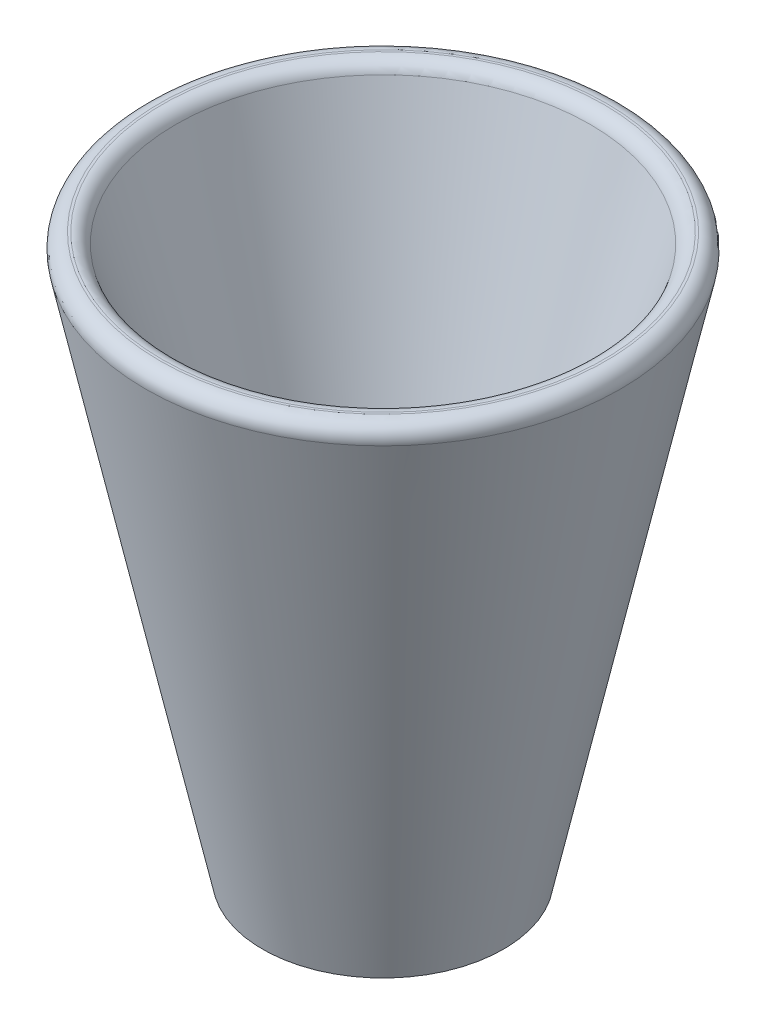
ISO-10303-21;
HEADER;
FILE_DESCRIPTION(('STEP AP214'),'2;1');
FILE_NAME('part.step','',(''),(''),'','','');
FILE_SCHEMA(('AUTOMOTIVE_DESIGN { 1 0 10303 214 1 1 1 1 }'));
ENDSEC;
DATA;
#1=APPLICATION_CONTEXT('core data for automotive mechanical design processes');
#2=APPLICATION_PROTOCOL_DEFINITION('international standard','automotive_design',2000,#1);
#3=PRODUCT_CONTEXT('',#1,'mechanical');
#4=PRODUCT('Part','Part','',(#3));
#5=PRODUCT_RELATED_PRODUCT_CATEGORY('part','',(#4));
#6=PRODUCT_DEFINITION_FORMATION('','',#4);
#7=PRODUCT_DEFINITION_CONTEXT('part definition',#1,'design');
#8=PRODUCT_DEFINITION('design','',#6,#7);
#9=PRODUCT_DEFINITION_SHAPE('','',#8);
#10=(LENGTH_UNIT() NAMED_UNIT(*) SI_UNIT(.MILLI.,.METRE.));
#11=(NAMED_UNIT(*) PLANE_ANGLE_UNIT() SI_UNIT($,.RADIAN.));
#12=(NAMED_UNIT(*) SI_UNIT($,.STERADIAN.) SOLID_ANGLE_UNIT());
#13=UNCERTAINTY_MEASURE_WITH_UNIT(LENGTH_MEASURE(1.E-05),#10,'distance_accuracy_value','');
#14=(GEOMETRIC_REPRESENTATION_CONTEXT(3) GLOBAL_UNCERTAINTY_ASSIGNED_CONTEXT((#13)) GLOBAL_UNIT_ASSIGNED_CONTEXT((#10,
#11,#12)) REPRESENTATION_CONTEXT('',''));
#15=CARTESIAN_POINT('',(0.,0.,0.));
#16=DIRECTION('',(0.,0.,1.));
#17=DIRECTION('',(1.,0.,0.));
#18=AXIS2_PLACEMENT_3D('',#15,#16,#17);
#19=CARTESIAN_POINT('',(0.,19.812,0.));
#20=DIRECTION('',(0.,-1.,0.));
#21=DIRECTION('',(1.,0.,0.));
#22=AXIS2_PLACEMENT_3D('',#19,#20,#21);
#23=SPHERICAL_SURFACE('',#22,9.652);
#24=CARTESIAN_POINT('',(0.,16.9828850001817,0.));
#25=DIRECTION('',(0.,-1.,0.));
#26=DIRECTION('',(0.,0.,-1.));
#27=AXIS2_PLACEMENT_3D('',#24,#25,#26);
#28=CIRCLE('',#27,9.22806655360717);
#29=CARTESIAN_POINT('',(0.,16.9828850001817,-9.22806655360717));
#30=VERTEX_POINT('',#29);
#31=EDGE_CURVE('E54',#30,#30,#28,.T.);
#32=ORIENTED_EDGE('',*,*,#31,.F.);
#33=EDGE_LOOP('',(#32));
#34=FACE_BOUND('',#33,.T.);
#35=ADVANCED_FACE('F31',(#34),#23,.F.);
#36=CARTESIAN_POINT('',(0.,59.1003871904065,0.));
#37=DIRECTION('',(0.,1.,0.));
#38=DIRECTION('',(0.,0.,1.));
#39=AXIS2_PLACEMENT_3D('',#36,#37,#38);
#40=CONICAL_SURFACE('',#39,22.1403333333333,0.297479965862811);
#41=CARTESIAN_POINT('',(0.,58.0230895587989,0.));
#42=DIRECTION('',(0.,-1.,0.));
#43=DIRECTION('',(0.,0.,-1.));
#44=AXIS2_PLACEMENT_3D('',#41,#42,#43);
#45=CIRCLE('',#44,21.8100584191739);
#46=CARTESIAN_POINT('',(0.,58.0230895587989,-21.8100584191739));
#47=VERTEX_POINT('',#46);
#48=EDGE_CURVE('E38',#47,#47,#45,.F.);
#49=ORIENTED_EDGE('',*,*,#48,.T.);
#50=EDGE_LOOP('',(#49));
#51=FACE_BOUND('',#50,.T.);
#52=ORIENTED_EDGE('',*,*,#31,.T.);
#53=EDGE_LOOP('',(#52));
#54=FACE_BOUND('',#53,.T.);
#55=ADVANCED_FACE('F81',(#51,#54),#40,.F.);
#56=CARTESIAN_POINT('',(25.4,59.1003871904065,0.));
#57=DIRECTION('',(0.,1.,0.));
#58=DIRECTION('',(0.,0.,1.));
#59=AXIS2_PLACEMENT_3D('',#56,#57,#58);
#60=PLANE('',#59);
#61=CARTESIAN_POINT('',(0.,59.1003871904065,0.));
#62=DIRECTION('',(0.,1.,0.));
#63=DIRECTION('',(0.,0.,1.));
#64=AXIS2_PLACEMENT_3D('',#61,#62,#63);
#65=CIRCLE('',#64,23.5137198901818);
#66=CARTESIAN_POINT('',(0.,59.1003871904065,23.5137198901818));
#67=VERTEX_POINT('',#66);
#68=EDGE_CURVE('E42',#67,#67,#65,.T.);
#69=ORIENTED_EDGE('',*,*,#68,.T.);
#70=EDGE_LOOP('',(#69));
#71=FACE_BOUND('',#70,.T.);
#72=CARTESIAN_POINT('',(0.,59.1003871904065,0.));
#73=DIRECTION('',(0.,1.,0.));
#74=DIRECTION('',(0.,0.,1.));
#75=AXIS2_PLACEMENT_3D('',#72,#73,#74);
#76=CIRCLE('',#75,23.2671215592172);
#77=CARTESIAN_POINT('',(0.,59.1003871904065,23.2671215592172));
#78=VERTEX_POINT('',#77);
#79=EDGE_CURVE('E46',#78,#78,#76,.F.);
#80=ORIENTED_EDGE('',*,*,#79,.T.);
#81=EDGE_LOOP('',(#80));
#82=FACE_BOUND('',#81,.T.);
#83=ADVANCED_FACE('F75',(#71,#82),#60,.T.);
#84=CARTESIAN_POINT('',(0.,0.,0.));
#85=DIRECTION('',(0.,1.,0.));
#86=DIRECTION('',(0.,0.,1.));
#87=AXIS2_PLACEMENT_3D('',#84,#85,#86);
#88=CONICAL_SURFACE('',#87,12.7,0.211669688219069);
#89=CARTESIAN_POINT('',(0.,57.2562060448338,0.));
#90=DIRECTION('',(0.,-1.,0.));
#91=DIRECTION('',(0.,0.,-1.));
#92=AXIS2_PLACEMENT_3D('',#89,#90,#91);
#93=CIRCLE('',#92,25.0037064787187);
#94=CARTESIAN_POINT('',(0.,57.2562060448338,-25.0037064787187));
#95=VERTEX_POINT('',#94);
#96=EDGE_CURVE('E51',#95,#95,#93,.T.);
#97=ORIENTED_EDGE('',*,*,#96,.T.);
#98=EDGE_LOOP('',(#97));
#99=FACE_BOUND('',#98,.T.);
#100=CARTESIAN_POINT('',(0.,0.,0.));
#101=DIRECTION('',(0.,-1.,0.));
#102=DIRECTION('',(0.,0.,-1.));
#103=AXIS2_PLACEMENT_3D('',#100,#101,#102);
#104=CIRCLE('',#103,12.7);
#105=CARTESIAN_POINT('',(0.,0.,-12.7));
#106=VERTEX_POINT('',#105);
#107=EDGE_CURVE('E57',#106,#106,#104,.T.);
#108=ORIENTED_EDGE('',*,*,#107,.F.);
#109=EDGE_LOOP('',(#108));
#110=FACE_BOUND('',#109,.T.);
#111=ADVANCED_FACE('F70',(#99,#110),#88,.T.);
#112=CARTESIAN_POINT('',(0.,0.,0.));
#113=DIRECTION('',(0.,-1.,0.));
#114=DIRECTION('',(0.,0.,-1.));
#115=AXIS2_PLACEMENT_3D('',#112,#113,#114);
#116=PLANE('',#115);
#117=CARTESIAN_POINT('',(0.,0.,0.));
#118=DIRECTION('',(0.,-1.,0.));
#119=DIRECTION('',(0.,0.,-1.));
#120=AXIS2_PLACEMENT_3D('',#117,#118,#119);
#121=CIRCLE('',#120,8.89);
#122=CARTESIAN_POINT('',(0.,0.,-8.89));
#123=VERTEX_POINT('',#122);
#124=EDGE_CURVE('E60',#123,#123,#121,.T.);
#125=ORIENTED_EDGE('',*,*,#124,.F.);
#126=EDGE_LOOP('',(#125));
#127=FACE_BOUND('',#126,.T.);
#128=ORIENTED_EDGE('',*,*,#107,.T.);
#129=EDGE_LOOP('',(#128));
#130=FACE_BOUND('',#129,.T.);
#131=ADVANCED_FACE('F66',(#127,#130),#116,.T.);
#132=CARTESIAN_POINT('',(0.,57.5763871904065,0.));
#133=DIRECTION('',(0.,1.,0.));
#134=DIRECTION('',(0.,0.,1.));
#135=AXIS2_PLACEMENT_3D('',#132,#133,#134);
#136=TOROIDAL_SURFACE('',#135,23.5137198901818,1.524);
#137=ORIENTED_EDGE('',*,*,#68,.F.);
#138=EDGE_LOOP('',(#137));
#139=FACE_BOUND('',#138,.T.);
#140=ORIENTED_EDGE('',*,*,#96,.F.);
#141=EDGE_LOOP('',(#140));
#142=FACE_BOUND('',#141,.T.);
#143=ADVANCED_FACE('F69',(#139,#142),#136,.T.);
#144=CARTESIAN_POINT('',(0.,57.5763871904065,0.));
#145=DIRECTION('',(0.,1.,0.));
#146=DIRECTION('',(0.,0.,1.));
#147=AXIS2_PLACEMENT_3D('',#144,#145,#146);
#148=TOROIDAL_SURFACE('',#147,23.2671215592172,1.524);
#149=ORIENTED_EDGE('',*,*,#48,.F.);
#150=EDGE_LOOP('',(#149));
#151=FACE_BOUND('',#150,.T.);
#152=ORIENTED_EDGE('',*,*,#79,.F.);
#153=EDGE_LOOP('',(#152));
#154=FACE_BOUND('',#153,.T.);
#155=ADVANCED_FACE('F94',(#151,#154),#148,.T.);
#156=CARTESIAN_POINT('',(0.,5.08,0.));
#157=DIRECTION('',(0.,-1.,0.));
#158=DIRECTION('',(0.,0.,-1.));
#159=AXIS2_PLACEMENT_3D('',#156,#157,#158);
#160=PLANE('',#159);
#161=CARTESIAN_POINT('',(0.,5.08,0.));
#162=DIRECTION('',(0.,-1.,0.));
#163=DIRECTION('',(0.,0.,-1.));
#164=AXIS2_PLACEMENT_3D('',#161,#162,#163);
#165=CIRCLE('',#164,3.81);
#166=CARTESIAN_POINT('',(0.,5.08,-3.81));
#167=VERTEX_POINT('',#166);
#168=EDGE_CURVE('E10',#167,#167,#165,.T.);
#169=ORIENTED_EDGE('',*,*,#168,.T.);
#170=EDGE_LOOP('',(#169));
#171=FACE_BOUND('',#170,.T.);
#172=ADVANCED_FACE('F97',(#171),#160,.T.);
#173=CARTESIAN_POINT('',(0.,0.,0.));
#174=DIRECTION('',(0.,-1.,0.));
#175=DIRECTION('',(0.,0.,-1.));
#176=AXIS2_PLACEMENT_3D('',#173,#174,#175);
#177=DEGENERATE_TOROIDAL_SURFACE('',#176,3.81,5.08,.T.);
#178=ORIENTED_EDGE('',*,*,#124,.T.);
#179=EDGE_LOOP('',(#178));
#180=FACE_BOUND('',#179,.T.);
#181=ORIENTED_EDGE('',*,*,#168,.F.);
#182=EDGE_LOOP('',(#181));
#183=FACE_BOUND('',#182,.T.);
#184=ADVANCED_FACE('F33',(#180,#183),#177,.F.);
#185=CLOSED_SHELL('',(#35,#55,#83,#111,#131,#143,#155,#172,#184));
#186=MANIFOLD_SOLID_BREP('B2',#185);
#187=ADVANCED_BREP_SHAPE_REPRESENTATION('',(#18,#186),#14);
#188=SHAPE_DEFINITION_REPRESENTATION(#9,#187);
ENDSEC;
END-ISO-10303-21;
